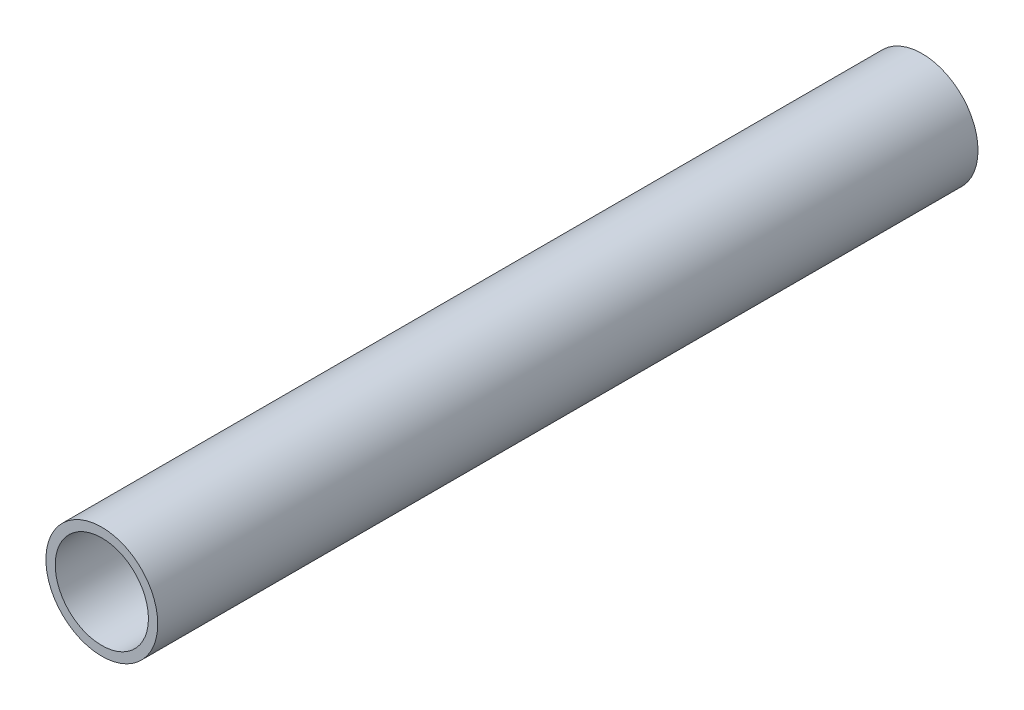
ISO-10303-21;
HEADER;
FILE_DESCRIPTION(('STEP AP214'),'2;1');
FILE_NAME('part.step','',(''),(''),'','','');
FILE_SCHEMA(('AUTOMOTIVE_DESIGN { 1 0 10303 214 1 1 1 1 }'));
ENDSEC;
DATA;
#1=APPLICATION_CONTEXT('core data for automotive mechanical design processes');
#2=APPLICATION_PROTOCOL_DEFINITION('international standard','automotive_design',2000,#1);
#3=PRODUCT_CONTEXT('',#1,'mechanical');
#4=PRODUCT('Part','Part','',(#3));
#5=PRODUCT_RELATED_PRODUCT_CATEGORY('part','',(#4));
#6=PRODUCT_DEFINITION_FORMATION('','',#4);
#7=PRODUCT_DEFINITION_CONTEXT('part definition',#1,'design');
#8=PRODUCT_DEFINITION('design','',#6,#7);
#9=PRODUCT_DEFINITION_SHAPE('','',#8);
#10=(LENGTH_UNIT() NAMED_UNIT(*) SI_UNIT(.MILLI.,.METRE.));
#11=(NAMED_UNIT(*) PLANE_ANGLE_UNIT() SI_UNIT($,.RADIAN.));
#12=(NAMED_UNIT(*) SI_UNIT($,.STERADIAN.) SOLID_ANGLE_UNIT());
#13=UNCERTAINTY_MEASURE_WITH_UNIT(LENGTH_MEASURE(1.E-05),#10,'distance_accuracy_value','');
#14=(GEOMETRIC_REPRESENTATION_CONTEXT(3) GLOBAL_UNCERTAINTY_ASSIGNED_CONTEXT((#13)) GLOBAL_UNIT_ASSIGNED_CONTEXT((#10,
#11,#12)) REPRESENTATION_CONTEXT('',''));
#15=CARTESIAN_POINT('',(0.,0.,0.));
#16=DIRECTION('',(0.,0.,1.));
#17=DIRECTION('',(1.,0.,0.));
#18=AXIS2_PLACEMENT_3D('',#15,#16,#17);
#19=CARTESIAN_POINT('',(0.,0.,279.4));
#20=DIRECTION('',(0.,0.,1.));
#21=DIRECTION('',(1.,0.,0.));
#22=AXIS2_PLACEMENT_3D('',#19,#20,#21);
#23=PLANE('',#22);
#24=CARTESIAN_POINT('',(0.,0.,279.4));
#25=DIRECTION('',(0.,0.,1.));
#26=DIRECTION('',(1.,0.,0.));
#27=AXIS2_PLACEMENT_3D('',#24,#25,#26);
#28=CIRCLE('',#27,19.05);
#29=CARTESIAN_POINT('',(19.05,0.,279.4));
#30=VERTEX_POINT('',#29);
#31=EDGE_CURVE('E10',#30,#30,#28,.T.);
#32=ORIENTED_EDGE('',*,*,#31,.T.);
#33=EDGE_LOOP('',(#32));
#34=FACE_BOUND('',#33,.T.);
#35=CARTESIAN_POINT('',(0.,0.,279.4));
#36=DIRECTION('',(0.,0.,1.));
#37=DIRECTION('',(1.,0.,0.));
#38=AXIS2_PLACEMENT_3D('',#35,#36,#37);
#39=CIRCLE('',#38,15.875);
#40=CARTESIAN_POINT('',(15.875,0.,279.4));
#41=VERTEX_POINT('',#40);
#42=EDGE_CURVE('E40',#41,#41,#39,.T.);
#43=ORIENTED_EDGE('',*,*,#42,.F.);
#44=EDGE_LOOP('',(#43));
#45=FACE_BOUND('',#44,.T.);
#46=ADVANCED_FACE('F29',(#34,#45),#23,.T.);
#47=CARTESIAN_POINT('',(0.,0.,0.));
#48=DIRECTION('',(0.,0.,1.));
#49=DIRECTION('',(1.,0.,0.));
#50=AXIS2_PLACEMENT_3D('',#47,#48,#49);
#51=PLANE('',#50);
#52=CARTESIAN_POINT('',(0.,0.,0.));
#53=DIRECTION('',(0.,0.,1.));
#54=DIRECTION('',(1.,0.,0.));
#55=AXIS2_PLACEMENT_3D('',#52,#53,#54);
#56=CIRCLE('',#55,19.05);
#57=CARTESIAN_POINT('',(19.05,0.,0.));
#58=VERTEX_POINT('',#57);
#59=EDGE_CURVE('E36',#58,#58,#56,.T.);
#60=ORIENTED_EDGE('',*,*,#59,.F.);
#61=EDGE_LOOP('',(#60));
#62=FACE_BOUND('',#61,.T.);
#63=CARTESIAN_POINT('',(0.,0.,0.));
#64=DIRECTION('',(0.,0.,1.));
#65=DIRECTION('',(1.,0.,0.));
#66=AXIS2_PLACEMENT_3D('',#63,#64,#65);
#67=CIRCLE('',#66,15.875);
#68=CARTESIAN_POINT('',(15.875,0.,0.));
#69=VERTEX_POINT('',#68);
#70=EDGE_CURVE('E44',#69,#69,#67,.T.);
#71=ORIENTED_EDGE('',*,*,#70,.T.);
#72=EDGE_LOOP('',(#71));
#73=FACE_BOUND('',#72,.T.);
#74=ADVANCED_FACE('F50',(#62,#73),#51,.F.);
#75=CARTESIAN_POINT('',(0.,0.,279.4));
#76=DIRECTION('',(0.,0.,-1.));
#77=DIRECTION('',(-1.,0.,0.));
#78=AXIS2_PLACEMENT_3D('',#75,#76,#77);
#79=CYLINDRICAL_SURFACE('',#78,19.05);
#80=ORIENTED_EDGE('',*,*,#31,.F.);
#81=EDGE_LOOP('',(#80));
#82=FACE_BOUND('',#81,.T.);
#83=ORIENTED_EDGE('',*,*,#59,.T.);
#84=EDGE_LOOP('',(#83));
#85=FACE_BOUND('',#84,.T.);
#86=ADVANCED_FACE('F31',(#82,#85),#79,.T.);
#87=CARTESIAN_POINT('',(0.,0.,279.4));
#88=DIRECTION('',(0.,0.,-1.));
#89=DIRECTION('',(-1.,0.,0.));
#90=AXIS2_PLACEMENT_3D('',#87,#88,#89);
#91=CYLINDRICAL_SURFACE('',#90,15.875);
#92=ORIENTED_EDGE('',*,*,#42,.T.);
#93=EDGE_LOOP('',(#92));
#94=FACE_BOUND('',#93,.T.);
#95=ORIENTED_EDGE('',*,*,#70,.F.);
#96=EDGE_LOOP('',(#95));
#97=FACE_BOUND('',#96,.T.);
#98=ADVANCED_FACE('F52',(#94,#97),#91,.F.);
#99=CLOSED_SHELL('',(#46,#74,#86,#98));
#100=MANIFOLD_SOLID_BREP('B2',#99);
#101=ADVANCED_BREP_SHAPE_REPRESENTATION('',(#18,#100),#14);
#102=SHAPE_DEFINITION_REPRESENTATION(#9,#101);
ENDSEC;
END-ISO-10303-21;
